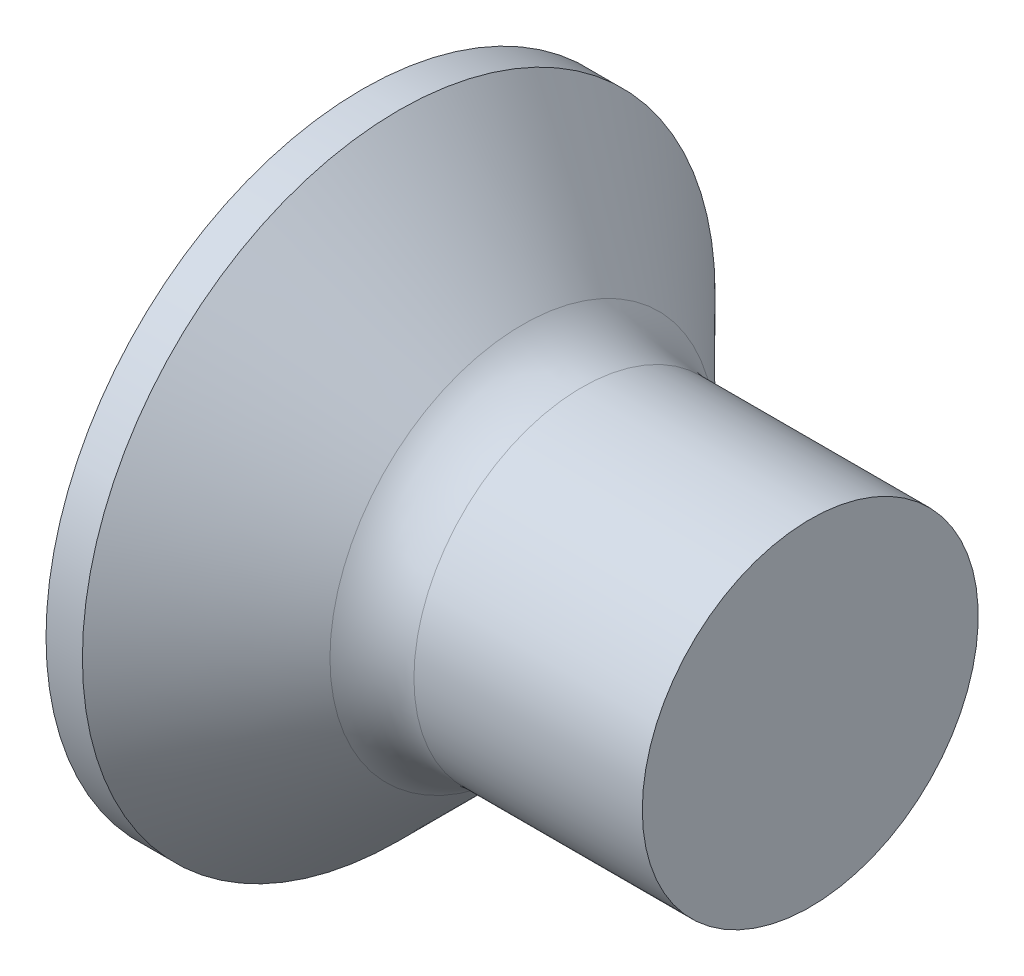
ISO-10303-21;
HEADER;
FILE_DESCRIPTION(('STEP AP214'),'2;1');
FILE_NAME('part.step','',(''),(''),'','','');
FILE_SCHEMA(('AUTOMOTIVE_DESIGN { 1 0 10303 214 1 1 1 1 }'));
ENDSEC;
DATA;
#1=APPLICATION_CONTEXT('core data for automotive mechanical design processes');
#2=APPLICATION_PROTOCOL_DEFINITION('international standard','automotive_design',2000,#1);
#3=PRODUCT_CONTEXT('',#1,'mechanical');
#4=PRODUCT('Part','Part','',(#3));
#5=PRODUCT_RELATED_PRODUCT_CATEGORY('part','',(#4));
#6=PRODUCT_DEFINITION_FORMATION('','',#4);
#7=PRODUCT_DEFINITION_CONTEXT('part definition',#1,'design');
#8=PRODUCT_DEFINITION('design','',#6,#7);
#9=PRODUCT_DEFINITION_SHAPE('','',#8);
#10=(LENGTH_UNIT() NAMED_UNIT(*) SI_UNIT(.MILLI.,.METRE.));
#11=(NAMED_UNIT(*) PLANE_ANGLE_UNIT() SI_UNIT($,.RADIAN.));
#12=(NAMED_UNIT(*) SI_UNIT($,.STERADIAN.) SOLID_ANGLE_UNIT());
#13=UNCERTAINTY_MEASURE_WITH_UNIT(LENGTH_MEASURE(1.E-05),#10,'distance_accuracy_value','');
#14=(GEOMETRIC_REPRESENTATION_CONTEXT(3) GLOBAL_UNCERTAINTY_ASSIGNED_CONTEXT((#13)) GLOBAL_UNIT_ASSIGNED_CONTEXT((#10,
#11,#12)) REPRESENTATION_CONTEXT('',''));
#15=CARTESIAN_POINT('',(0.,0.,0.));
#16=DIRECTION('',(0.,0.,1.));
#17=DIRECTION('',(1.,0.,0.));
#18=AXIS2_PLACEMENT_3D('',#15,#16,#17);
#19=CARTESIAN_POINT('',(3.45,-1.57989373987161,0.71));
#20=DIRECTION('',(0.,0.,-1.));
#21=DIRECTION('',(0.,1.,0.));
#22=AXIS2_PLACEMENT_3D('',#19,#20,#21);
#23=PLANE('',#22);
#24=DIRECTION('',(0.,-1.,0.));
#25=VECTOR('',#24,1.);
#26=CARTESIAN_POINT('',(0.,3.3,0.71));
#27=LINE('',#26,#25);
#28=CARTESIAN_POINT('',(0.,-1.34596265082799,0.71));
#29=VERTEX_POINT('',#28);
#30=CARTESIAN_POINT('',(0.,-3.3,0.71));
#31=VERTEX_POINT('',#30);
#32=EDGE_CURVE('E312',#29,#31,#27,.T.);
#33=ORIENTED_EDGE('',*,*,#32,.F.);
#34=CARTESIAN_POINT('',(-2.33070172998508,-1.52780949048026,0.71));
#35=CARTESIAN_POINT('',(-1.86765508847817,-1.49209744049213,0.71));
#36=CARTESIAN_POINT('',(-1.40462429920518,-1.45617785782921,0.71));
#37=CARTESIAN_POINT('',(-0.478598771397555,-1.38378441953518,0.71));
#38=CARTESIAN_POINT('',(-0.0156040335424545,-1.34731055521734,0.71));
#39=CARTESIAN_POINT('',(0.910330236395165,-1.27367048002272,0.71));
#40=CARTESIAN_POINT('',(1.37326976851081,-1.23650426956358,0.71));
#41=CARTESIAN_POINT('',(2.06762023653994,-1.18007469405108,0.71));
#42=CARTESIAN_POINT('',(2.29905881427871,-1.16115160652012,0.71));
#43=CARTESIAN_POINT('',(2.76191562133488,-1.1230403895321,0.71));
#44=CARTESIAN_POINT('',(2.9933338505087,-1.10385225833566,0.71));
#45=CARTESIAN_POINT('',(3.77873671984917,-1.0382140373185,0.71));
#46=CARTESIAN_POINT('',(4.33266232972328,-0.991049175883736,0.71));
#47=CARTESIAN_POINT('',(5.16336946909758,-0.91831891167068,0.71));
#48=CARTESIAN_POINT('',(5.4402378234452,-0.893745347104484,0.71));
#49=CARTESIAN_POINT('',(5.99389989386117,-0.843746126629445,0.71));
#50=CARTESIAN_POINT('',(6.27069360937684,-0.818320464576653,0.71));
#51=CARTESIAN_POINT('',(6.82421204003487,-0.766348392465499,0.71));
#52=CARTESIAN_POINT('',(7.10093674169551,-0.739801838455808,0.71));
#53=CARTESIAN_POINT('',(7.65423177691248,-0.68518575083711,0.71));
#54=CARTESIAN_POINT('',(7.93080211342568,-0.657116247487933,0.71));
#55=CARTESIAN_POINT('',(8.34549763265326,-0.613341372671413,0.71));
#56=CARTESIAN_POINT('',(8.48371076462783,-0.598470406405426,0.71));
#57=CARTESIAN_POINT('',(8.76005877549585,-0.568027000653936,0.71));
#58=CARTESIAN_POINT('',(8.8981936550194,-0.552454566900562,0.71));
#59=CARTESIAN_POINT('',(9.17437105230597,-0.520423781188751,0.71));
#60=CARTESIAN_POINT('',(9.31241356323649,-0.503965369751123,0.71));
#61=CARTESIAN_POINT('',(9.58835148685425,-0.469831580758205,0.71));
#62=CARTESIAN_POINT('',(9.72624689529722,-0.452156169004854,0.71));
#63=CARTESIAN_POINT('',(9.86404214924837,-0.433706703068899,0.71));
#64=B_SPLINE_CURVE_WITH_KNOTS('',3,(#34,#35,#36,#37,#38,#39,#40,#41,#42,#43,#44,#45,#46,#47,#48,
#49,#50,#51,#52,#53,#54,#55,#56,#57,#58,#59,#60,#61,#62,#63),.UNSPECIFIED.,.F.,.F.,(4,2,2,2,2,2,
2,2,2,2,2,2,2,2,4),(0.,1.39326536277937,2.78655258345763,4.17983896374136,4.87647147762522,
5.57310856540425,7.2408931063301,8.07476240245648,8.90863771239455,9.7426204410271,
10.5765866051289,10.9936177320625,11.4106454517929,11.8277012032456,12.2447686788719),.UNSPECIFIED.);
#65=CARTESIAN_POINT('',(3.45,-1.06563607765503,0.710000000000001));
#66=VERTEX_POINT('',#65);
#67=EDGE_CURVE('E192',#29,#66,#64,.T.);
#68=ORIENTED_EDGE('',*,*,#67,.T.);
#69=DIRECTION('',(0.,-1.,0.));
#70=VECTOR('',#69,1.);
#71=CARTESIAN_POINT('',(3.45,1.57989373987161,0.71));
#72=LINE('',#71,#70);
#73=CARTESIAN_POINT('',(3.45,-1.57989373987161,0.71));
#74=VERTEX_POINT('',#73);
#75=EDGE_CURVE('E336',#66,#74,#72,.T.);
#76=ORIENTED_EDGE('',*,*,#75,.T.);
#77=DIRECTION('',(0.894934391398442,0.446197753347436,0.));
#78=VECTOR('',#77,1.);
#79=CARTESIAN_POINT('',(0.,-3.3,0.71));
#80=LINE('',#79,#78);
#81=EDGE_CURVE('E323',#31,#74,#80,.T.);
#82=ORIENTED_EDGE('',*,*,#81,.F.);
#83=EDGE_LOOP('',(#33,#68,#76,#82));
#84=FACE_BOUND('',#83,.T.);
#85=ADVANCED_FACE('F34',(#84),#23,.T.);
#86=CARTESIAN_POINT('',(3.45,1.57989373987161,0.71));
#87=VERTEX_POINT('',#86);
#88=CARTESIAN_POINT('',(3.45,1.06563607765503,0.71));
#89=VERTEX_POINT('',#88);
#90=EDGE_CURVE('E338',#87,#89,#72,.T.);
#91=ORIENTED_EDGE('',*,*,#90,.T.);
#92=CARTESIAN_POINT('',(-2.33070173866617,1.52780949114965,0.71));
#93=CARTESIAN_POINT('',(-1.8676550960516,1.49209744107883,0.71));
#94=CARTESIAN_POINT('',(-1.40462430567099,1.45617785833256,0.71));
#95=CARTESIAN_POINT('',(-0.478598775648202,1.38378441986965,0.71));
#96=CARTESIAN_POINT('',(-0.0156040366855543,1.34731055546627,0.71));
#97=CARTESIAN_POINT('',(0.910330236180616,1.27367048004082,0.71));
#98=CARTESIAN_POINT('',(1.37326977011718,1.2365042694353,0.71));
#99=CARTESIAN_POINT('',(2.06762024087716,1.18007469369746,0.71));
#100=CARTESIAN_POINT('',(2.29905881952609,1.16115160609043,0.71));
#101=CARTESIAN_POINT('',(2.76191562840241,1.12304038894781,0.71));
#102=CARTESIAN_POINT('',(2.99333385848622,1.10385225767286,0.71));
#103=CARTESIAN_POINT('',(3.77873672873618,1.03821403656624,0.71));
#104=CARTESIAN_POINT('',(4.33266233860977,0.991049175120265,0.71));
#105=CARTESIAN_POINT('',(5.16336947798272,0.918318910885573,0.71));
#106=CARTESIAN_POINT('',(5.44023783232977,0.893745346311365,0.71));
#107=CARTESIAN_POINT('',(5.99389990274437,0.843746125817967,0.71));
#108=CARTESIAN_POINT('',(6.27069361825925,0.818320463754828,0.71));
#109=CARTESIAN_POINT('',(6.82421204891561,0.76634839161947,0.71));
#110=CARTESIAN_POINT('',(7.10093675057538,0.73980183759592,0.71));
#111=CARTESIAN_POINT('',(7.65423178578991,0.685185749944023,0.71));
#112=CARTESIAN_POINT('',(7.93080212230156,0.657116246575507,0.71));
#113=CARTESIAN_POINT('',(8.34549764152604,0.613341371722657,0.71));
#114=CARTESIAN_POINT('',(8.48371077349952,0.598470405443331,0.71));
#115=CARTESIAN_POINT('',(8.7600587843649,0.56802699966167,0.71));
#116=CARTESIAN_POINT('',(8.8981936638869,0.552454565891464,0.71));
#117=CARTESIAN_POINT('',(9.17437106116977,0.520423780141059,0.71));
#118=CARTESIAN_POINT('',(9.31241357209815,0.50396536868167,0.71));
#119=CARTESIAN_POINT('',(9.58835149571046,0.469831579636994,0.71));
#120=CARTESIAN_POINT('',(9.7262469041501,0.452156167853647,0.71));
#121=CARTESIAN_POINT('',(9.86404215809699,0.433706701881929,0.71));
#122=B_SPLINE_CURVE_WITH_KNOTS('',3,(#92,#93,#94,#95,#96,#97,#98,#99,#100,#101,#102,#103,#104,
#105,#106,#107,#108,#109,#110,#111,#112,#113,#114,#115,#116,#117,#118,#119,#120,#121),
.UNSPECIFIED.,.F.,.F.,(4,2,2,2,2,2,2,2,2,2,2,2,2,2,4),(0.,1.3932653661116,2.78655259012239,
4.17983897588649,4.87647149251036,5.57310858302948,7.24089312395658,8.07476242008336,
8.9086377300219,9.74262045865579,10.5765866227588,10.9936177496934,11.4106454694248,
11.8277012208788,12.2447686965066),.UNSPECIFIED.);
#123=CARTESIAN_POINT('',(0.,1.34596265082799,0.71));
#124=VERTEX_POINT('',#123);
#125=EDGE_CURVE('E185',#89,#124,#122,.F.);
#126=ORIENTED_EDGE('',*,*,#125,.T.);
#127=CARTESIAN_POINT('',(0.,3.3,0.71));
#128=VERTEX_POINT('',#127);
#129=EDGE_CURVE('E314',#128,#124,#27,.T.);
#130=ORIENTED_EDGE('',*,*,#129,.F.);
#131=DIRECTION('',(0.894934391398442,-0.446197753347436,0.));
#132=VECTOR('',#131,1.);
#133=CARTESIAN_POINT('',(0.,3.3,0.71));
#134=LINE('',#133,#132);
#135=EDGE_CURVE('E63',#128,#87,#134,.T.);
#136=ORIENTED_EDGE('',*,*,#135,.T.);
#137=EDGE_LOOP('',(#91,#126,#130,#136));
#138=FACE_BOUND('',#137,.T.);
#139=ADVANCED_FACE('F167',(#138),#23,.T.);
#140=CARTESIAN_POINT('',(3.45,1.57989373987161,-0.71));
#141=DIRECTION('',(0.,0.,1.));
#142=DIRECTION('',(1.,0.,0.));
#143=AXIS2_PLACEMENT_3D('',#140,#141,#142);
#144=PLANE('',#143);
#145=DIRECTION('',(0.,1.,0.));
#146=VECTOR('',#145,1.);
#147=CARTESIAN_POINT('',(3.45,-1.57989373987161,-0.71));
#148=LINE('',#147,#146);
#149=CARTESIAN_POINT('',(3.45,-1.57989373987161,-0.71));
#150=VERTEX_POINT('',#149);
#151=CARTESIAN_POINT('',(3.45,-1.06563607765503,-0.71));
#152=VERTEX_POINT('',#151);
#153=EDGE_CURVE('E337',#150,#152,#148,.T.);
#154=ORIENTED_EDGE('',*,*,#153,.T.);
#155=CARTESIAN_POINT('',(-2.33070172998508,-1.52780949048026,-0.71));
#156=CARTESIAN_POINT('',(-1.86765508847817,-1.49209744049213,-0.71));
#157=CARTESIAN_POINT('',(-1.40462429920518,-1.45617785782921,-0.71));
#158=CARTESIAN_POINT('',(-0.478598771397555,-1.38378441953518,-0.71));
#159=CARTESIAN_POINT('',(-0.0156040335424545,-1.34731055521734,-0.71));
#160=CARTESIAN_POINT('',(0.910330236395165,-1.27367048002272,-0.71));
#161=CARTESIAN_POINT('',(1.37326976851081,-1.23650426956358,-0.71));
#162=CARTESIAN_POINT('',(2.06762023653994,-1.18007469405108,-0.71));
#163=CARTESIAN_POINT('',(2.29905881427871,-1.16115160652012,-0.71));
#164=CARTESIAN_POINT('',(2.76191562133488,-1.1230403895321,-0.71));
#165=CARTESIAN_POINT('',(2.9933338505087,-1.10385225833566,-0.71));
#166=CARTESIAN_POINT('',(3.77873671984917,-1.0382140373185,-0.71));
#167=CARTESIAN_POINT('',(4.33266232972328,-0.991049175883736,-0.71));
#168=CARTESIAN_POINT('',(5.16336946909758,-0.91831891167068,-0.71));
#169=CARTESIAN_POINT('',(5.4402378234452,-0.893745347104483,-0.71));
#170=CARTESIAN_POINT('',(5.99389989386117,-0.843746126629445,-0.71));
#171=CARTESIAN_POINT('',(6.27069360937684,-0.818320464576653,-0.71));
#172=CARTESIAN_POINT('',(6.82421204003487,-0.766348392465499,-0.71));
#173=CARTESIAN_POINT('',(7.10093674169552,-0.739801838455808,-0.71));
#174=CARTESIAN_POINT('',(7.65423177691248,-0.685185750837109,-0.71));
#175=CARTESIAN_POINT('',(7.93080211342569,-0.657116247487933,-0.71));
#176=CARTESIAN_POINT('',(8.34549763265326,-0.613341372671412,-0.71));
#177=CARTESIAN_POINT('',(8.48371076462783,-0.598470406405425,-0.71));
#178=CARTESIAN_POINT('',(8.76005877549585,-0.568027000653936,-0.71));
#179=CARTESIAN_POINT('',(8.89819365501941,-0.552454566900562,-0.71));
#180=CARTESIAN_POINT('',(9.17437105230597,-0.52042378118875,-0.71));
#181=CARTESIAN_POINT('',(9.31241356323649,-0.503965369751123,-0.71));
#182=CARTESIAN_POINT('',(9.58835148685426,-0.469831580758204,-0.71));
#183=CARTESIAN_POINT('',(9.72624689529723,-0.452156169004853,-0.71));
#184=CARTESIAN_POINT('',(9.86404214924837,-0.433706703068898,-0.71));
#185=B_SPLINE_CURVE_WITH_KNOTS('',3,(#155,#156,#157,#158,#159,#160,#161,#162,#163,#164,#165,
#166,#167,#168,#169,#170,#171,#172,#173,#174,#175,#176,#177,#178,#179,#180,#181,#182,#183,#184),
.UNSPECIFIED.,.F.,.F.,(4,2,2,2,2,2,2,2,2,2,2,2,2,2,4),(0.,1.39326536277937,2.78655258345763,
4.17983896374136,4.87647147762522,5.57310856540425,7.24089310633011,8.07476240245648,
8.90863771239455,9.7426204410271,10.5765866051289,10.9936177320625,11.4106454517929,
11.8277012032456,12.244768678872),.UNSPECIFIED.);
#186=CARTESIAN_POINT('',(0.,-1.34596265082799,-0.71));
#187=VERTEX_POINT('',#186);
#188=EDGE_CURVE('E238',#152,#187,#185,.F.);
#189=ORIENTED_EDGE('',*,*,#188,.T.);
#190=DIRECTION('',(0.,1.,0.));
#191=VECTOR('',#190,1.);
#192=CARTESIAN_POINT('',(0.,-3.3,-0.71));
#193=LINE('',#192,#191);
#194=CARTESIAN_POINT('',(0.,-3.3,-0.71));
#195=VERTEX_POINT('',#194);
#196=EDGE_CURVE('E313',#195,#187,#193,.T.);
#197=ORIENTED_EDGE('',*,*,#196,.F.);
#198=DIRECTION('',(0.894934391398443,0.446197753347436,0.));
#199=VECTOR('',#198,1.);
#200=CARTESIAN_POINT('',(0.,-3.3,-0.71));
#201=LINE('',#200,#199);
#202=EDGE_CURVE('E326',#195,#150,#201,.T.);
#203=ORIENTED_EDGE('',*,*,#202,.T.);
#204=EDGE_LOOP('',(#154,#189,#197,#203));
#205=FACE_BOUND('',#204,.T.);
#206=ADVANCED_FACE('F173',(#205),#144,.T.);
#207=CARTESIAN_POINT('',(0.,1.34596265082799,-0.71));
#208=VERTEX_POINT('',#207);
#209=CARTESIAN_POINT('',(0.,3.3,-0.71));
#210=VERTEX_POINT('',#209);
#211=EDGE_CURVE('E322',#208,#210,#193,.T.);
#212=ORIENTED_EDGE('',*,*,#211,.F.);
#213=CARTESIAN_POINT('',(-2.33070172998508,1.52780949048026,-0.71));
#214=CARTESIAN_POINT('',(-1.86765508847817,1.49209744049213,-0.71));
#215=CARTESIAN_POINT('',(-1.40462429920518,1.45617785782921,-0.71));
#216=CARTESIAN_POINT('',(-0.478598771397555,1.38378441953518,-0.71));
#217=CARTESIAN_POINT('',(-0.0156040335424545,1.34731055521734,-0.71));
#218=CARTESIAN_POINT('',(0.910330236395165,1.27367048002272,-0.71));
#219=CARTESIAN_POINT('',(1.37326976851081,1.23650426956358,-0.71));
#220=CARTESIAN_POINT('',(2.06762023653994,1.18007469405108,-0.71));
#221=CARTESIAN_POINT('',(2.29905881427871,1.16115160652012,-0.71));
#222=CARTESIAN_POINT('',(2.76191562133488,1.1230403895321,-0.71));
#223=CARTESIAN_POINT('',(2.9933338505087,1.10385225833566,-0.71));
#224=CARTESIAN_POINT('',(3.77873671984917,1.0382140373185,-0.71));
#225=CARTESIAN_POINT('',(4.33266232972328,0.991049175883737,-0.71));
#226=CARTESIAN_POINT('',(5.16336946909758,0.91831891167068,-0.71));
#227=CARTESIAN_POINT('',(5.4402378234452,0.893745347104483,-0.71));
#228=CARTESIAN_POINT('',(5.99389989386117,0.843746126629445,-0.71));
#229=CARTESIAN_POINT('',(6.27069360937684,0.818320464576653,-0.71));
#230=CARTESIAN_POINT('',(6.82421204003487,0.766348392465499,-0.71));
#231=CARTESIAN_POINT('',(7.10093674169551,0.739801838455808,-0.71));
#232=CARTESIAN_POINT('',(7.65423177691248,0.685185750837109,-0.71));
#233=CARTESIAN_POINT('',(7.93080211342568,0.657116247487933,-0.71));
#234=CARTESIAN_POINT('',(8.34549763265326,0.613341372671413,-0.71));
#235=CARTESIAN_POINT('',(8.48371076462783,0.598470406405425,-0.71));
#236=CARTESIAN_POINT('',(8.76005877549585,0.568027000653936,-0.71));
#237=CARTESIAN_POINT('',(8.8981936550194,0.552454566900562,-0.71));
#238=CARTESIAN_POINT('',(9.17437105230597,0.520423781188751,-0.71));
#239=CARTESIAN_POINT('',(9.31241356323649,0.503965369751123,-0.71));
#240=CARTESIAN_POINT('',(9.58835148685425,0.469831580758205,-0.71));
#241=CARTESIAN_POINT('',(9.72624689529722,0.452156169004853,-0.71));
#242=CARTESIAN_POINT('',(9.86404214924837,0.433706703068899,-0.71));
#243=B_SPLINE_CURVE_WITH_KNOTS('',3,(#213,#214,#215,#216,#217,#218,#219,#220,#221,#222,#223,
#224,#225,#226,#227,#228,#229,#230,#231,#232,#233,#234,#235,#236,#237,#238,#239,#240,#241,#242),
.UNSPECIFIED.,.F.,.F.,(4,2,2,2,2,2,2,2,2,2,2,2,2,2,4),(0.,1.39326536277937,2.78655258345763,
4.17983896374136,4.87647147762522,5.57310856540425,7.2408931063301,8.07476240245648,
8.90863771239455,9.7426204410271,10.5765866051289,10.9936177320625,11.4106454517929,
11.8277012032456,12.2447686788719),.UNSPECIFIED.);
#244=CARTESIAN_POINT('',(3.45,1.06563607765503,-0.71));
#245=VERTEX_POINT('',#244);
#246=EDGE_CURVE('E233',#208,#245,#243,.T.);
#247=ORIENTED_EDGE('',*,*,#246,.T.);
#248=CARTESIAN_POINT('',(3.45,1.57989373987161,-0.71));
#249=VERTEX_POINT('',#248);
#250=EDGE_CURVE('E343',#245,#249,#148,.T.);
#251=ORIENTED_EDGE('',*,*,#250,.T.);
#252=DIRECTION('',(0.894934391398442,-0.446197753347436,0.));
#253=VECTOR('',#252,1.);
#254=CARTESIAN_POINT('',(0.,3.3,-0.71));
#255=LINE('',#254,#253);
#256=EDGE_CURVE('E330',#210,#249,#255,.T.);
#257=ORIENTED_EDGE('',*,*,#256,.F.);
#258=EDGE_LOOP('',(#212,#247,#251,#257));
#259=FACE_BOUND('',#258,.T.);
#260=ADVANCED_FACE('F460',(#259),#144,.T.);
#261=CARTESIAN_POINT('',(3.45,1.57989373987161,-0.71));
#262=DIRECTION('',(1.,0.,0.));
#263=DIRECTION('',(0.,0.,-1.));
#264=AXIS2_PLACEMENT_3D('',#261,#262,#263);
#265=PLANE('',#264);
#266=CARTESIAN_POINT('',(3.45,0.,0.));
#267=DIRECTION('',(-1.,0.,0.));
#268=DIRECTION('',(0.,0.,1.));
#269=AXIS2_PLACEMENT_3D('',#266,#267,#268);
#270=CIRCLE('',#269,1.2805);
#271=EDGE_CURVE('E282',#152,#66,#270,.T.);
#272=ORIENTED_EDGE('',*,*,#271,.F.);
#273=ORIENTED_EDGE('',*,*,#153,.F.);
#274=DIRECTION('',(0.,0.,-1.));
#275=VECTOR('',#274,1.);
#276=CARTESIAN_POINT('',(3.45,-1.57989373987161,0.71));
#277=LINE('',#276,#275);
#278=EDGE_CURVE('E333',#74,#150,#277,.T.);
#279=ORIENTED_EDGE('',*,*,#278,.F.);
#280=ORIENTED_EDGE('',*,*,#75,.F.);
#281=EDGE_LOOP('',(#272,#273,#279,#280));
#282=FACE_BOUND('',#281,.T.);
#283=ADVANCED_FACE('F417',(#282),#265,.F.);
#284=CARTESIAN_POINT('',(3.45,-0.710000000000004,1.06563607765503));
#285=VERTEX_POINT('',#284);
#286=CARTESIAN_POINT('',(3.45,0.709999999999996,1.06563607765503));
#287=VERTEX_POINT('',#286);
#288=EDGE_CURVE('E275',#285,#287,#270,.T.);
#289=ORIENTED_EDGE('',*,*,#288,.F.);
#290=DIRECTION('',(0.,0.,-1.));
#291=VECTOR('',#290,1.);
#292=CARTESIAN_POINT('',(3.45,-0.710000000000005,1.57989373987161));
#293=LINE('',#292,#291);
#294=CARTESIAN_POINT('',(3.45,-0.710000000000005,1.57989373987161));
#295=VERTEX_POINT('',#294);
#296=EDGE_CURVE('E402',#295,#285,#293,.T.);
#297=ORIENTED_EDGE('',*,*,#296,.F.);
#298=DIRECTION('',(0.,-1.,0.));
#299=VECTOR('',#298,1.);
#300=CARTESIAN_POINT('',(3.45,0.709999999999994,1.57989373987161));
#301=LINE('',#300,#299);
#302=CARTESIAN_POINT('',(3.45,0.709999999999994,1.57989373987161));
#303=VERTEX_POINT('',#302);
#304=EDGE_CURVE('E301',#303,#295,#301,.T.);
#305=ORIENTED_EDGE('',*,*,#304,.F.);
#306=DIRECTION('',(0.,0.,1.));
#307=VECTOR('',#306,1.);
#308=CARTESIAN_POINT('',(3.45,0.710000000000005,-1.5798937398716));
#309=LINE('',#308,#307);
#310=EDGE_CURVE('E199',#287,#303,#309,.T.);
#311=ORIENTED_EDGE('',*,*,#310,.F.);
#312=EDGE_LOOP('',(#289,#297,#305,#311));
#313=FACE_BOUND('',#312,.T.);
#314=ADVANCED_FACE('F452',(#313),#265,.F.);
#315=EDGE_CURVE('E274',#89,#245,#270,.T.);
#316=ORIENTED_EDGE('',*,*,#315,.F.);
#317=ORIENTED_EDGE('',*,*,#90,.F.);
#318=DIRECTION('',(0.,0.,1.));
#319=VECTOR('',#318,1.);
#320=CARTESIAN_POINT('',(3.45,1.57989373987161,-0.71));
#321=LINE('',#320,#319);
#322=EDGE_CURVE('E334',#249,#87,#321,.T.);
#323=ORIENTED_EDGE('',*,*,#322,.F.);
#324=ORIENTED_EDGE('',*,*,#250,.F.);
#325=EDGE_LOOP('',(#316,#317,#323,#324));
#326=FACE_BOUND('',#325,.T.);
#327=ADVANCED_FACE('F432',(#326),#265,.F.);
#328=CARTESIAN_POINT('',(3.45,0.709999999999994,1.57989373987161));
#329=DIRECTION('',(0.,-1.,0.));
#330=DIRECTION('',(1.,0.,0.));
#331=AXIS2_PLACEMENT_3D('',#328,#329,#330);
#332=PLANE('',#331);
#333=CARTESIAN_POINT('',(3.45,0.710000000000005,-1.5798937398716));
#334=VERTEX_POINT('',#333);
#335=CARTESIAN_POINT('',(3.45,0.710000000000004,-1.06563607765503));
#336=VERTEX_POINT('',#335);
#337=EDGE_CURVE('E296',#334,#336,#309,.T.);
#338=ORIENTED_EDGE('',*,*,#337,.T.);
#339=CARTESIAN_POINT('',(-2.33070172998508,0.710000000000005,-1.52780949048025));
#340=CARTESIAN_POINT('',(-1.86765508847817,0.710000000000005,-1.49209744049212));
#341=CARTESIAN_POINT('',(-1.40462429920518,0.710000000000005,-1.45617785782921));
#342=CARTESIAN_POINT('',(-0.478598771397555,0.710000000000005,-1.38378441953518));
#343=CARTESIAN_POINT('',(-0.0156040335424547,0.710000000000005,-1.34731055521733));
#344=CARTESIAN_POINT('',(0.910330236395165,0.710000000000004,-1.27367048002272));
#345=CARTESIAN_POINT('',(1.37326976851081,0.710000000000004,-1.23650426956357));
#346=CARTESIAN_POINT('',(2.06762023653994,0.710000000000004,-1.18007469405108));
#347=CARTESIAN_POINT('',(2.29905881427871,0.710000000000004,-1.16115160652012));
#348=CARTESIAN_POINT('',(2.76191562133488,0.710000000000004,-1.12304038953209));
#349=CARTESIAN_POINT('',(2.9933338505087,0.710000000000004,-1.10385225833565));
#350=CARTESIAN_POINT('',(3.77873671984917,0.710000000000004,-1.0382140373185));
#351=CARTESIAN_POINT('',(4.33266232972328,0.710000000000003,-0.991049175883734));
#352=CARTESIAN_POINT('',(5.16336946909758,0.710000000000003,-0.918318911670678));
#353=CARTESIAN_POINT('',(5.44023782344519,0.710000000000003,-0.893745347104481));
#354=CARTESIAN_POINT('',(5.99389989386117,0.710000000000003,-0.843746126629442));
#355=CARTESIAN_POINT('',(6.27069360937684,0.710000000000003,-0.818320464576651));
#356=CARTESIAN_POINT('',(6.82421204003487,0.710000000000003,-0.766348392465497));
#357=CARTESIAN_POINT('',(7.10093674169551,0.710000000000003,-0.739801838455806));
#358=CARTESIAN_POINT('',(7.65423177691247,0.710000000000002,-0.685185750837107));
#359=CARTESIAN_POINT('',(7.93080211342568,0.710000000000002,-0.657116247487931));
#360=CARTESIAN_POINT('',(8.34549763265326,0.710000000000002,-0.61334137267141));
#361=CARTESIAN_POINT('',(8.48371076462783,0.710000000000002,-0.598470406405423));
#362=CARTESIAN_POINT('',(8.76005877549585,0.710000000000002,-0.568027000653934));
#363=CARTESIAN_POINT('',(8.89819365501941,0.710000000000002,-0.552454566900559));
#364=CARTESIAN_POINT('',(9.17437105230597,0.710000000000002,-0.520423781188748));
#365=CARTESIAN_POINT('',(9.31241356323649,0.710000000000002,-0.50396536975112));
#366=CARTESIAN_POINT('',(9.58835148685426,0.710000000000002,-0.469831580758202));
#367=CARTESIAN_POINT('',(9.72624689529723,0.710000000000002,-0.452156169004851));
#368=CARTESIAN_POINT('',(9.86404214924837,0.710000000000002,-0.433706703068896));
#369=B_SPLINE_CURVE_WITH_KNOTS('',3,(#339,#340,#341,#342,#343,#344,#345,#346,#347,#348,#349,
#350,#351,#352,#353,#354,#355,#356,#357,#358,#359,#360,#361,#362,#363,#364,#365,#366,#367,#368),
.UNSPECIFIED.,.F.,.F.,(4,2,2,2,2,2,2,2,2,2,2,2,2,2,4),(0.,1.39326536277937,2.78655258345763,
4.17983896374136,4.87647147762522,5.57310856540425,7.2408931063301,8.07476240245647,
8.90863771239455,9.7426204410271,10.5765866051289,10.9936177320625,11.4106454517929,
11.8277012032456,12.2447686788719),.UNSPECIFIED.);
#370=CARTESIAN_POINT('',(0.,0.710000000000005,-1.34596265082799));
#371=VERTEX_POINT('',#370);
#372=EDGE_CURVE('E226',#336,#371,#369,.F.);
#373=ORIENTED_EDGE('',*,*,#372,.T.);
#374=DIRECTION('',(0.,0.,1.));
#375=VECTOR('',#374,1.);
#376=CARTESIAN_POINT('',(0.,0.710000000000011,-3.3));
#377=LINE('',#376,#375);
#378=CARTESIAN_POINT('',(0.,0.710000000000011,-3.3));
#379=VERTEX_POINT('',#378);
#380=EDGE_CURVE('E391',#379,#371,#377,.T.);
#381=ORIENTED_EDGE('',*,*,#380,.F.);
#382=DIRECTION('',(0.894934391398443,0.,0.446197753347436));
#383=VECTOR('',#382,1.);
#384=CARTESIAN_POINT('',(0.,0.710000000000011,-3.3));
#385=LINE('',#384,#383);
#386=EDGE_CURVE('E300',#379,#334,#385,.T.);
#387=ORIENTED_EDGE('',*,*,#386,.T.);
#388=EDGE_LOOP('',(#338,#373,#381,#387));
#389=FACE_BOUND('',#388,.T.);
#390=ADVANCED_FACE('F299',(#389),#332,.T.);
#391=CARTESIAN_POINT('',(3.45,-0.709999999999995,-1.57989373987161));
#392=DIRECTION('',(0.,1.,0.));
#393=DIRECTION('',(0.,0.,1.));
#394=AXIS2_PLACEMENT_3D('',#391,#392,#393);
#395=PLANE('',#394);
#396=DIRECTION('',(0.,0.,-1.));
#397=VECTOR('',#396,1.);
#398=CARTESIAN_POINT('',(0.,-0.710000000000011,3.3));
#399=LINE('',#398,#397);
#400=CARTESIAN_POINT('',(0.,-0.709999999999995,-1.345962650828));
#401=VERTEX_POINT('',#400);
#402=CARTESIAN_POINT('',(0.,-0.709999999999989,-3.3));
#403=VERTEX_POINT('',#402);
#404=EDGE_CURVE('E387',#401,#403,#399,.T.);
#405=ORIENTED_EDGE('',*,*,#404,.F.);
#406=CARTESIAN_POINT('',(-2.33070173866617,-0.709999999999995,-1.52780949114965));
#407=CARTESIAN_POINT('',(-1.8676550960516,-0.709999999999995,-1.49209744107883));
#408=CARTESIAN_POINT('',(-1.40462430567099,-0.709999999999995,-1.45617785833257));
#409=CARTESIAN_POINT('',(-0.478598775648203,-0.709999999999995,-1.38378441986965));
#410=CARTESIAN_POINT('',(-0.0156040366855545,-0.709999999999995,-1.34731055546627));
#411=CARTESIAN_POINT('',(0.910330236180616,-0.709999999999996,-1.27367048004082));
#412=CARTESIAN_POINT('',(1.37326977011718,-0.709999999999996,-1.2365042694353));
#413=CARTESIAN_POINT('',(2.06762024087716,-0.709999999999996,-1.18007469369747));
#414=CARTESIAN_POINT('',(2.29905881952609,-0.709999999999996,-1.16115160609043));
#415=CARTESIAN_POINT('',(2.76191562840241,-0.709999999999996,-1.12304038894781));
#416=CARTESIAN_POINT('',(2.99333385848622,-0.709999999999996,-1.10385225767286));
#417=CARTESIAN_POINT('',(3.77873672873618,-0.709999999999996,-1.03821403656625));
#418=CARTESIAN_POINT('',(4.33266233860976,-0.709999999999997,-0.991049175120267));
#419=CARTESIAN_POINT('',(5.16336947798272,-0.709999999999997,-0.918318910885576));
#420=CARTESIAN_POINT('',(5.44023783232976,-0.709999999999997,-0.893745346311368));
#421=CARTESIAN_POINT('',(5.99389990274437,-0.709999999999997,-0.84374612581797));
#422=CARTESIAN_POINT('',(6.27069361825925,-0.709999999999997,-0.818320463754831));
#423=CARTESIAN_POINT('',(6.82421204891561,-0.709999999999997,-0.766348391619473));
#424=CARTESIAN_POINT('',(7.10093675057537,-0.709999999999997,-0.739801837595923));
#425=CARTESIAN_POINT('',(7.6542317857899,-0.709999999999998,-0.685185749944026));
#426=CARTESIAN_POINT('',(7.93080212230155,-0.709999999999998,-0.65711624657551));
#427=CARTESIAN_POINT('',(8.34549764152603,-0.709999999999998,-0.61334137172266));
#428=CARTESIAN_POINT('',(8.48371077349952,-0.709999999999998,-0.598470405443334));
#429=CARTESIAN_POINT('',(8.7600587843649,-0.709999999999998,-0.568026999661673));
#430=CARTESIAN_POINT('',(8.89819366388689,-0.709999999999998,-0.552454565891467));
#431=CARTESIAN_POINT('',(9.17437106116977,-0.709999999999998,-0.520423780141062));
#432=CARTESIAN_POINT('',(9.31241357209815,-0.709999999999998,-0.503965368681673));
#433=CARTESIAN_POINT('',(9.58835149571046,-0.709999999999998,-0.469831579636997));
#434=CARTESIAN_POINT('',(9.72624690415009,-0.709999999999998,-0.45215616785365));
#435=CARTESIAN_POINT('',(9.86404215809699,-0.709999999999998,-0.433706701881932));
#436=B_SPLINE_CURVE_WITH_KNOTS('',3,(#406,#407,#408,#409,#410,#411,#412,#413,#414,#415,#416,
#417,#418,#419,#420,#421,#422,#423,#424,#425,#426,#427,#428,#429,#430,#431,#432,#433,#434,#435),
.UNSPECIFIED.,.F.,.F.,(4,2,2,2,2,2,2,2,2,2,2,2,2,2,4),(0.,1.3932653661116,2.78655259012239,
4.17983897588649,4.87647149251036,5.57310858302948,7.24089312395658,8.07476242008335,
8.90863773002189,9.74262045865578,10.5765866227588,10.9936177496934,11.4106454694247,
11.8277012208788,12.2447686965066),.UNSPECIFIED.);
#437=CARTESIAN_POINT('',(3.45,-0.709999999999996,-1.06563607765503));
#438=VERTEX_POINT('',#437);
#439=EDGE_CURVE('E219',#401,#438,#436,.T.);
#440=ORIENTED_EDGE('',*,*,#439,.T.);
#441=CARTESIAN_POINT('',(3.45,-0.709999999999995,-1.57989373987161));
#442=VERTEX_POINT('',#441);
#443=EDGE_CURVE('E298',#438,#442,#293,.T.);
#444=ORIENTED_EDGE('',*,*,#443,.T.);
#445=DIRECTION('',(0.894934391398442,0.,0.446197753347436));
#446=VECTOR('',#445,1.);
#447=CARTESIAN_POINT('',(0.,-0.709999999999989,-3.3));
#448=LINE('',#447,#446);
#449=EDGE_CURVE('E394',#403,#442,#448,.T.);
#450=ORIENTED_EDGE('',*,*,#449,.F.);
#451=EDGE_LOOP('',(#405,#440,#444,#450));
#452=FACE_BOUND('',#451,.T.);
#453=ADVANCED_FACE('F405',(#452),#395,.T.);
#454=ORIENTED_EDGE('',*,*,#296,.T.);
#455=CARTESIAN_POINT('',(-2.33070173866617,-0.710000000000005,1.52780949114964));
#456=CARTESIAN_POINT('',(-1.8676550960516,-0.710000000000005,1.49209744107883));
#457=CARTESIAN_POINT('',(-1.40462430567099,-0.710000000000005,1.45617785833256));
#458=CARTESIAN_POINT('',(-0.478598775648202,-0.710000000000005,1.38378441986965));
#459=CARTESIAN_POINT('',(-0.0156040366855544,-0.710000000000005,1.34731055546627));
#460=CARTESIAN_POINT('',(0.910330236180616,-0.710000000000004,1.27367048004082));
#461=CARTESIAN_POINT('',(1.37326977011718,-0.710000000000004,1.2365042694353));
#462=CARTESIAN_POINT('',(2.06762024087716,-0.710000000000004,1.18007469369746));
#463=CARTESIAN_POINT('',(2.29905881952609,-0.710000000000004,1.16115160609042));
#464=CARTESIAN_POINT('',(2.76191562840241,-0.710000000000004,1.12304038894781));
#465=CARTESIAN_POINT('',(2.99333385848622,-0.710000000000004,1.10385225767286));
#466=CARTESIAN_POINT('',(3.77873672873618,-0.710000000000004,1.03821403656624));
#467=CARTESIAN_POINT('',(4.33266233860976,-0.710000000000003,0.991049175120263));
#468=CARTESIAN_POINT('',(5.16336947798272,-0.710000000000003,0.918318910885571));
#469=CARTESIAN_POINT('',(5.44023783232976,-0.710000000000003,0.893745346311363));
#470=CARTESIAN_POINT('',(5.99389990274436,-0.710000000000003,0.843746125817966));
#471=CARTESIAN_POINT('',(6.27069361825924,-0.710000000000003,0.818320463754827));
#472=CARTESIAN_POINT('',(6.82421204891561,-0.710000000000003,0.766348391619469));
#473=CARTESIAN_POINT('',(7.10093675057537,-0.710000000000002,0.739801837595919));
#474=CARTESIAN_POINT('',(7.6542317857899,-0.710000000000002,0.685185749944022));
#475=CARTESIAN_POINT('',(7.93080212230155,-0.710000000000002,0.657116246575506));
#476=CARTESIAN_POINT('',(8.34549764152603,-0.710000000000002,0.613341371722656));
#477=CARTESIAN_POINT('',(8.48371077349952,-0.710000000000002,0.598470405443329));
#478=CARTESIAN_POINT('',(8.76005878436489,-0.710000000000002,0.568026999661669));
#479=CARTESIAN_POINT('',(8.89819366388689,-0.710000000000002,0.552454565891462));
#480=CARTESIAN_POINT('',(9.17437106116977,-0.710000000000002,0.520423780141058));
#481=CARTESIAN_POINT('',(9.31241357209815,-0.710000000000002,0.503965368681668));
#482=CARTESIAN_POINT('',(9.58835149571046,-0.710000000000001,0.469831579636992));
#483=CARTESIAN_POINT('',(9.72624690415009,-0.710000000000001,0.452156167853645));
#484=CARTESIAN_POINT('',(9.86404215809699,-0.710000000000001,0.433706701881927));
#485=B_SPLINE_CURVE_WITH_KNOTS('',3,(#455,#456,#457,#458,#459,#460,#461,#462,#463,#464,#465,
#466,#467,#468,#469,#470,#471,#472,#473,#474,#475,#476,#477,#478,#479,#480,#481,#482,#483,#484),
.UNSPECIFIED.,.F.,.F.,(4,2,2,2,2,2,2,2,2,2,2,2,2,2,4),(0.,1.3932653661116,2.78655259012239,
4.17983897588649,4.87647149251036,5.57310858302948,7.24089312395658,8.07476242008335,
8.90863773002189,9.74262045865577,10.5765866227588,10.9936177496934,11.4106454694247,
11.8277012208788,12.2447686965066),.UNSPECIFIED.);
#486=CARTESIAN_POINT('',(0.,-0.710000000000005,1.34596265082799));
#487=VERTEX_POINT('',#486);
#488=EDGE_CURVE('E211',#285,#487,#485,.F.);
#489=ORIENTED_EDGE('',*,*,#488,.T.);
#490=CARTESIAN_POINT('',(0.,-0.710000000000011,3.3));
#491=VERTEX_POINT('',#490);
#492=EDGE_CURVE('E383',#491,#487,#399,.T.);
#493=ORIENTED_EDGE('',*,*,#492,.F.);
#494=DIRECTION('',(0.894934391398442,0.,-0.446197753347436));
#495=VECTOR('',#494,1.);
#496=CARTESIAN_POINT('',(0.,-0.710000000000011,3.3));
#497=LINE('',#496,#495);
#498=EDGE_CURVE('E398',#491,#295,#497,.T.);
#499=ORIENTED_EDGE('',*,*,#498,.T.);
#500=EDGE_LOOP('',(#454,#489,#493,#499));
#501=FACE_BOUND('',#500,.T.);
#502=ADVANCED_FACE('F436',(#501),#395,.T.);
#503=CARTESIAN_POINT('',(0.,0.709999999999995,1.345962650828));
#504=VERTEX_POINT('',#503);
#505=CARTESIAN_POINT('',(0.,0.709999999999988,3.3));
#506=VERTEX_POINT('',#505);
#507=EDGE_CURVE('E393',#504,#506,#377,.T.);
#508=ORIENTED_EDGE('',*,*,#507,.F.);
#509=CARTESIAN_POINT('',(-2.33070173866617,0.709999999999994,1.52780949114965));
#510=CARTESIAN_POINT('',(-1.8676550960516,0.709999999999995,1.49209744107883));
#511=CARTESIAN_POINT('',(-1.40462430567099,0.709999999999995,1.45617785833257));
#512=CARTESIAN_POINT('',(-0.478598775648203,0.709999999999995,1.38378441986965));
#513=CARTESIAN_POINT('',(-0.0156040366855547,0.709999999999995,1.34731055546627));
#514=CARTESIAN_POINT('',(0.910330236180616,0.709999999999995,1.27367048004082));
#515=CARTESIAN_POINT('',(1.37326977011718,0.709999999999996,1.2365042694353));
#516=CARTESIAN_POINT('',(2.06762024087716,0.709999999999996,1.18007469369747));
#517=CARTESIAN_POINT('',(2.29905881952609,0.709999999999996,1.16115160609043));
#518=CARTESIAN_POINT('',(2.76191562840241,0.709999999999996,1.12304038894781));
#519=CARTESIAN_POINT('',(2.99333385848622,0.709999999999996,1.10385225767286));
#520=CARTESIAN_POINT('',(3.77873672873618,0.709999999999996,1.03821403656624));
#521=CARTESIAN_POINT('',(4.33266233860977,0.709999999999996,0.991049175120267));
#522=CARTESIAN_POINT('',(5.16336947798272,0.709999999999997,0.918318910885576));
#523=CARTESIAN_POINT('',(5.44023783232976,0.709999999999997,0.893745346311368));
#524=CARTESIAN_POINT('',(5.99389990274437,0.709999999999997,0.84374612581797));
#525=CARTESIAN_POINT('',(6.27069361825925,0.709999999999997,0.818320463754831));
#526=CARTESIAN_POINT('',(6.82421204891561,0.709999999999997,0.766348391619473));
#527=CARTESIAN_POINT('',(7.10093675057538,0.709999999999997,0.739801837595923));
#528=CARTESIAN_POINT('',(7.65423178578991,0.709999999999998,0.685185749944026));
#529=CARTESIAN_POINT('',(7.93080212230155,0.709999999999998,0.65711624657551));
#530=CARTESIAN_POINT('',(8.34549764152603,0.709999999999998,0.61334137172266));
#531=CARTESIAN_POINT('',(8.48371077349952,0.709999999999998,0.598470405443334));
#532=CARTESIAN_POINT('',(8.7600587843649,0.709999999999998,0.568026999661673));
#533=CARTESIAN_POINT('',(8.89819366388689,0.709999999999998,0.552454565891467));
#534=CARTESIAN_POINT('',(9.17437106116977,0.709999999999998,0.520423780141062));
#535=CARTESIAN_POINT('',(9.31241357209815,0.709999999999998,0.503965368681672));
#536=CARTESIAN_POINT('',(9.58835149571046,0.709999999999999,0.469831579636996));
#537=CARTESIAN_POINT('',(9.7262469041501,0.709999999999999,0.452156167853649));
#538=CARTESIAN_POINT('',(9.86404215809699,0.709999999999999,0.433706701881931));
#539=B_SPLINE_CURVE_WITH_KNOTS('',3,(#509,#510,#511,#512,#513,#514,#515,#516,#517,#518,#519,
#520,#521,#522,#523,#524,#525,#526,#527,#528,#529,#530,#531,#532,#533,#534,#535,#536,#537,#538),
.UNSPECIFIED.,.F.,.F.,(4,2,2,2,2,2,2,2,2,2,2,2,2,2,4),(0.,1.3932653661116,2.78655259012239,
4.17983897588649,4.87647149251036,5.57310858302948,7.24089312395658,8.07476242008335,
8.90863773002189,9.74262045865578,10.5765866227588,10.9936177496934,11.4106454694247,
11.8277012208788,12.2447686965066),.UNSPECIFIED.);
#540=EDGE_CURVE('E11',#504,#287,#539,.T.);
#541=ORIENTED_EDGE('',*,*,#540,.T.);
#542=ORIENTED_EDGE('',*,*,#310,.T.);
#543=DIRECTION('',(0.894934391398442,0.,-0.446197753347436));
#544=VECTOR('',#543,1.);
#545=CARTESIAN_POINT('',(0.,0.709999999999988,3.3));
#546=LINE('',#545,#544);
#547=EDGE_CURVE('E400',#506,#303,#546,.T.);
#548=ORIENTED_EDGE('',*,*,#547,.F.);
#549=EDGE_LOOP('',(#508,#541,#542,#548));
#550=FACE_BOUND('',#549,.T.);
#551=ADVANCED_FACE('F380',(#550),#332,.T.);
#552=CARTESIAN_POINT('',(0.,0.,0.));
#553=DIRECTION('',(-1.,0.,0.));
#554=DIRECTION('',(0.,0.,1.));
#555=AXIS2_PLACEMENT_3D('',#552,#553,#554);
#556=PLANE('',#555);
#557=CARTESIAN_POINT('',(0.,0.,0.));
#558=DIRECTION('',(-1.,0.,0.));
#559=DIRECTION('',(0.,0.,1.));
#560=AXIS2_PLACEMENT_3D('',#557,#558,#559);
#561=CIRCLE('',#560,5.65);
#562=CARTESIAN_POINT('',(0.,0.,5.65));
#563=VERTEX_POINT('',#562);
#564=EDGE_CURVE('E320',#563,#563,#561,.T.);
#565=ORIENTED_EDGE('',*,*,#564,.T.);
#566=EDGE_LOOP('',(#565));
#567=FACE_BOUND('',#566,.T.);
#568=ORIENTED_EDGE('',*,*,#492,.T.);
#569=CARTESIAN_POINT('',(0.,0.,0.));
#570=DIRECTION('',(-1.,0.,0.));
#571=DIRECTION('',(0.,0.,1.));
#572=AXIS2_PLACEMENT_3D('',#569,#570,#571);
#573=CIRCLE('',#572,1.52174750120508);
#574=EDGE_CURVE('E268',#29,#487,#573,.T.);
#575=ORIENTED_EDGE('',*,*,#574,.F.);
#576=ORIENTED_EDGE('',*,*,#32,.T.);
#577=DIRECTION('',(0.,0.,-1.));
#578=VECTOR('',#577,1.);
#579=CARTESIAN_POINT('',(0.,-3.3,0.71));
#580=LINE('',#579,#578);
#581=EDGE_CURVE('E317',#31,#195,#580,.T.);
#582=ORIENTED_EDGE('',*,*,#581,.T.);
#583=ORIENTED_EDGE('',*,*,#196,.T.);
#584=EDGE_CURVE('E270',#401,#187,#573,.T.);
#585=ORIENTED_EDGE('',*,*,#584,.F.);
#586=ORIENTED_EDGE('',*,*,#404,.T.);
#587=DIRECTION('',(0.,1.,0.));
#588=VECTOR('',#587,1.);
#589=CARTESIAN_POINT('',(0.,-0.709999999999989,-3.3));
#590=LINE('',#589,#588);
#591=EDGE_CURVE('E386',#403,#379,#590,.T.);
#592=ORIENTED_EDGE('',*,*,#591,.T.);
#593=ORIENTED_EDGE('',*,*,#380,.T.);
#594=EDGE_CURVE('E267',#208,#371,#573,.T.);
#595=ORIENTED_EDGE('',*,*,#594,.F.);
#596=ORIENTED_EDGE('',*,*,#211,.T.);
#597=DIRECTION('',(0.,0.,1.));
#598=VECTOR('',#597,1.);
#599=CARTESIAN_POINT('',(0.,3.3,-0.71));
#600=LINE('',#599,#598);
#601=EDGE_CURVE('E309',#210,#128,#600,.T.);
#602=ORIENTED_EDGE('',*,*,#601,.T.);
#603=ORIENTED_EDGE('',*,*,#129,.T.);
#604=EDGE_CURVE('E263',#504,#124,#573,.T.);
#605=ORIENTED_EDGE('',*,*,#604,.F.);
#606=ORIENTED_EDGE('',*,*,#507,.T.);
#607=DIRECTION('',(0.,-1.,0.));
#608=VECTOR('',#607,1.);
#609=CARTESIAN_POINT('',(0.,0.709999999999988,3.3));
#610=LINE('',#609,#608);
#611=EDGE_CURVE('E200',#506,#491,#610,.T.);
#612=ORIENTED_EDGE('',*,*,#611,.T.);
#613=EDGE_LOOP('',(#568,#575,#576,#582,#583,#585,#586,#592,#593,#595,#596,#602,#603,#605,#606,#612));
#614=FACE_BOUND('',#613,.T.);
#615=ADVANCED_FACE('F376',(#567,#614),#556,.T.);
#616=CARTESIAN_POINT('',(8.,3.,0.));
#617=DIRECTION('',(1.,0.,0.));
#618=DIRECTION('',(0.,0.,-1.));
#619=AXIS2_PLACEMENT_3D('',#616,#617,#618);
#620=PLANE('',#619);
#621=CARTESIAN_POINT('',(8.,0.,0.));
#622=DIRECTION('',(-1.,0.,0.));
#623=DIRECTION('',(0.,0.,1.));
#624=AXIS2_PLACEMENT_3D('',#621,#622,#623);
#625=CIRCLE('',#624,3.);
#626=CARTESIAN_POINT('',(8.,0.,3.));
#627=VERTEX_POINT('',#626);
#628=EDGE_CURVE('E349',#627,#627,#625,.T.);
#629=ORIENTED_EDGE('',*,*,#628,.F.);
#630=EDGE_LOOP('',(#629));
#631=FACE_BOUND('',#630,.T.);
#632=ADVANCED_FACE('F379',(#631),#620,.T.);
#633=CARTESIAN_POINT('',(-6.34999999999999,0.,0.));
#634=DIRECTION('',(-1.,0.,0.));
#635=DIRECTION('',(0.,0.,1.));
#636=AXIS2_PLACEMENT_3D('',#633,#634,#635);
#637=CYLINDRICAL_SURFACE('',#636,3.);
#638=CARTESIAN_POINT('',(3.92132034355964,0.,0.));
#639=DIRECTION('',(-1.,0.,0.));
#640=DIRECTION('',(0.,0.,1.));
#641=AXIS2_PLACEMENT_3D('',#638,#639,#640);
#642=CIRCLE('',#641,3.);
#643=CARTESIAN_POINT('',(3.92132034355964,0.,3.));
#644=VERTEX_POINT('',#643);
#645=EDGE_CURVE('E48',#644,#644,#642,.F.);
#646=ORIENTED_EDGE('',*,*,#645,.T.);
#647=EDGE_LOOP('',(#646));
#648=FACE_BOUND('',#647,.T.);
#649=ORIENTED_EDGE('',*,*,#628,.T.);
#650=EDGE_LOOP('',(#649));
#651=FACE_BOUND('',#650,.T.);
#652=ADVANCED_FACE('F357',(#648,#651),#637,.T.);
#653=CARTESIAN_POINT('',(0.65000000000001,0.,0.));
#654=DIRECTION('',(-1.,0.,0.));
#655=DIRECTION('',(0.,0.,1.));
#656=AXIS2_PLACEMENT_3D('',#653,#654,#655);
#657=CONICAL_SURFACE('',#656,5.65,0.78539816339745);
#658=CARTESIAN_POINT('',(2.86066017177982,0.,0.));
#659=DIRECTION('',(-1.,0.,0.));
#660=DIRECTION('',(0.,0.,1.));
#661=AXIS2_PLACEMENT_3D('',#658,#659,#660);
#662=CIRCLE('',#661,3.43933982822018);
#663=CARTESIAN_POINT('',(2.86066017177982,0.,3.43933982822018));
#664=VERTEX_POINT('',#663);
#665=EDGE_CURVE('E352',#664,#664,#662,.T.);
#666=ORIENTED_EDGE('',*,*,#665,.T.);
#667=EDGE_LOOP('',(#666));
#668=FACE_BOUND('',#667,.T.);
#669=CARTESIAN_POINT('',(0.65000000000001,0.,0.));
#670=DIRECTION('',(-1.,0.,0.));
#671=DIRECTION('',(0.,0.,1.));
#672=AXIS2_PLACEMENT_3D('',#669,#670,#671);
#673=CIRCLE('',#672,5.65);
#674=CARTESIAN_POINT('',(0.65000000000001,0.,5.65));
#675=VERTEX_POINT('',#674);
#676=EDGE_CURVE('E346',#675,#675,#673,.T.);
#677=ORIENTED_EDGE('',*,*,#676,.F.);
#678=EDGE_LOOP('',(#677));
#679=FACE_BOUND('',#678,.T.);
#680=ADVANCED_FACE('F365',(#668,#679),#657,.T.);
#681=CARTESIAN_POINT('',(-6.34999999999999,0.,0.));
#682=DIRECTION('',(-1.,0.,0.));
#683=DIRECTION('',(0.,0.,1.));
#684=AXIS2_PLACEMENT_3D('',#681,#682,#683);
#685=CYLINDRICAL_SURFACE('',#684,5.65);
#686=ORIENTED_EDGE('',*,*,#676,.T.);
#687=EDGE_LOOP('',(#686));
#688=FACE_BOUND('',#687,.T.);
#689=ORIENTED_EDGE('',*,*,#564,.F.);
#690=EDGE_LOOP('',(#689));
#691=FACE_BOUND('',#690,.T.);
#692=ADVANCED_FACE('F362',(#688,#691),#685,.T.);
#693=CARTESIAN_POINT('',(3.92132034355964,0.,0.));
#694=DIRECTION('',(-1.,0.,0.));
#695=DIRECTION('',(0.,0.,1.));
#696=AXIS2_PLACEMENT_3D('',#693,#694,#695);
#697=TOROIDAL_SURFACE('',#696,4.5,1.5);
#698=ORIENTED_EDGE('',*,*,#645,.F.);
#699=EDGE_LOOP('',(#698));
#700=FACE_BOUND('',#699,.T.);
#701=ORIENTED_EDGE('',*,*,#665,.F.);
#702=EDGE_LOOP('',(#701));
#703=FACE_BOUND('',#702,.T.);
#704=ADVANCED_FACE('F36',(#700,#703),#697,.F.);
#705=EDGE_CURVE('E287',#336,#438,#270,.T.);
#706=ORIENTED_EDGE('',*,*,#705,.F.);
#707=ORIENTED_EDGE('',*,*,#337,.F.);
#708=DIRECTION('',(0.,1.,0.));
#709=VECTOR('',#708,1.);
#710=CARTESIAN_POINT('',(3.45,-0.709999999999995,-1.57989373987161));
#711=LINE('',#710,#709);
#712=EDGE_CURVE('E307',#442,#334,#711,.T.);
#713=ORIENTED_EDGE('',*,*,#712,.F.);
#714=ORIENTED_EDGE('',*,*,#443,.F.);
#715=EDGE_LOOP('',(#706,#707,#713,#714));
#716=FACE_BOUND('',#715,.T.);
#717=ADVANCED_FACE('F294',(#716),#265,.F.);
#718=CARTESIAN_POINT('',(3.45,-1.57989373987161,-0.71));
#719=DIRECTION('',(-0.446197753347436,0.894934391398443,0.));
#720=DIRECTION('',(-0.894934391398443,-0.446197753347436,0.));
#721=AXIS2_PLACEMENT_3D('',#718,#719,#720);
#722=PLANE('',#721);
#723=ORIENTED_EDGE('',*,*,#202,.F.);
#724=ORIENTED_EDGE('',*,*,#581,.F.);
#725=ORIENTED_EDGE('',*,*,#81,.T.);
#726=ORIENTED_EDGE('',*,*,#278,.T.);
#727=EDGE_LOOP('',(#723,#724,#725,#726));
#728=FACE_BOUND('',#727,.T.);
#729=ADVANCED_FACE('F179',(#728),#722,.T.);
#730=CARTESIAN_POINT('',(3.45,1.57989373987161,0.71));
#731=DIRECTION('',(-0.446197753347436,-0.894934391398443,0.));
#732=DIRECTION('',(0.894934391398443,-0.446197753347436,0.));
#733=AXIS2_PLACEMENT_3D('',#730,#731,#732);
#734=PLANE('',#733);
#735=ORIENTED_EDGE('',*,*,#135,.F.);
#736=ORIENTED_EDGE('',*,*,#601,.F.);
#737=ORIENTED_EDGE('',*,*,#256,.T.);
#738=ORIENTED_EDGE('',*,*,#322,.T.);
#739=EDGE_LOOP('',(#735,#736,#737,#738));
#740=FACE_BOUND('',#739,.T.);
#741=ADVANCED_FACE('F429',(#740),#734,.T.);
#742=CARTESIAN_POINT('',(3.45,0.710000000000005,-1.5798937398716));
#743=DIRECTION('',(-0.446197753347436,0.,0.894934391398443));
#744=DIRECTION('',(-0.894934391398443,0.,-0.446197753347436));
#745=AXIS2_PLACEMENT_3D('',#742,#743,#744);
#746=PLANE('',#745);
#747=ORIENTED_EDGE('',*,*,#386,.F.);
#748=ORIENTED_EDGE('',*,*,#591,.F.);
#749=ORIENTED_EDGE('',*,*,#449,.T.);
#750=ORIENTED_EDGE('',*,*,#712,.T.);
#751=EDGE_LOOP('',(#747,#748,#749,#750));
#752=FACE_BOUND('',#751,.T.);
#753=ADVANCED_FACE('F204',(#752),#746,.T.);
#754=CARTESIAN_POINT('',(3.45,-0.710000000000005,1.57989373987161));
#755=DIRECTION('',(-0.446197753347436,0.,-0.894934391398443));
#756=DIRECTION('',(0.894934391398443,0.,-0.446197753347436));
#757=AXIS2_PLACEMENT_3D('',#754,#755,#756);
#758=PLANE('',#757);
#759=ORIENTED_EDGE('',*,*,#498,.F.);
#760=ORIENTED_EDGE('',*,*,#611,.F.);
#761=ORIENTED_EDGE('',*,*,#547,.T.);
#762=ORIENTED_EDGE('',*,*,#304,.T.);
#763=EDGE_LOOP('',(#759,#760,#761,#762));
#764=FACE_BOUND('',#763,.T.);
#765=ADVANCED_FACE('F420',(#764),#758,.T.);
#766=CARTESIAN_POINT('',(3.45,0.,0.));
#767=DIRECTION('',(-1.,0.,0.));
#768=DIRECTION('',(0.,0.,1.));
#769=AXIS2_PLACEMENT_3D('',#766,#767,#768);
#770=CONICAL_SURFACE('',#769,1.2805,0.0698131700797659);
#771=ORIENTED_EDGE('',*,*,#574,.T.);
#772=ORIENTED_EDGE('',*,*,#488,.F.);
#773=EDGE_CURVE('E279',#66,#285,#270,.T.);
#774=ORIENTED_EDGE('',*,*,#773,.F.);
#775=ORIENTED_EDGE('',*,*,#67,.F.);
#776=EDGE_LOOP('',(#771,#772,#774,#775));
#777=FACE_BOUND('',#776,.T.);
#778=ADVANCED_FACE('F165',(#777),#770,.F.);
#779=EDGE_CURVE('E55',#287,#89,#270,.T.);
#780=ORIENTED_EDGE('',*,*,#779,.F.);
#781=ORIENTED_EDGE('',*,*,#540,.F.);
#782=ORIENTED_EDGE('',*,*,#604,.T.);
#783=ORIENTED_EDGE('',*,*,#125,.F.);
#784=EDGE_LOOP('',(#780,#781,#782,#783));
#785=FACE_BOUND('',#784,.T.);
#786=ADVANCED_FACE('F419',(#785),#770,.F.);
#787=ORIENTED_EDGE('',*,*,#594,.T.);
#788=ORIENTED_EDGE('',*,*,#372,.F.);
#789=EDGE_CURVE('E278',#245,#336,#270,.T.);
#790=ORIENTED_EDGE('',*,*,#789,.F.);
#791=ORIENTED_EDGE('',*,*,#246,.F.);
#792=EDGE_LOOP('',(#787,#788,#790,#791));
#793=FACE_BOUND('',#792,.T.);
#794=ADVANCED_FACE('F163',(#793),#770,.F.);
#795=EDGE_CURVE('E284',#438,#152,#270,.T.);
#796=ORIENTED_EDGE('',*,*,#795,.F.);
#797=ORIENTED_EDGE('',*,*,#439,.F.);
#798=ORIENTED_EDGE('',*,*,#584,.T.);
#799=ORIENTED_EDGE('',*,*,#188,.F.);
#800=EDGE_LOOP('',(#796,#797,#798,#799));
#801=FACE_BOUND('',#800,.T.);
#802=ADVANCED_FACE('F157',(#801),#770,.F.);
#803=CARTESIAN_POINT('',(3.86605967102623,0.,0.));
#804=DIRECTION('',(-1.,0.,0.));
#805=DIRECTION('',(0.,0.,1.));
#806=AXIS2_PLACEMENT_3D('',#803,#804,#805);
#807=CONICAL_SURFACE('',#806,0.,1.25663706143592);
#808=ORIENTED_EDGE('',*,*,#779,.T.);
#809=ORIENTED_EDGE('',*,*,#315,.T.);
#810=ORIENTED_EDGE('',*,*,#789,.T.);
#811=ORIENTED_EDGE('',*,*,#705,.T.);
#812=ORIENTED_EDGE('',*,*,#795,.T.);
#813=ORIENTED_EDGE('',*,*,#271,.T.);
#814=ORIENTED_EDGE('',*,*,#773,.T.);
#815=ORIENTED_EDGE('',*,*,#288,.T.);
#816=EDGE_LOOP('',(#808,#809,#810,#811,#812,#813,#814,#815));
#817=FACE_BOUND('',#816,.T.);
#818=CARTESIAN_POINT('',(3.86605967102623,0.,0.));
#819=VERTEX_POINT('',#818);
#820=VERTEX_LOOP('',#819);
#821=FACE_BOUND('',#820,.T.);
#822=ADVANCED_FACE('F155',(#817,#821),#807,.F.);
#823=CLOSED_SHELL('',(#85,#139,#206,#260,#283,#314,#327,#390,#453,#502,#551,#615,#632,#652,#680,
#692,#704,#717,#729,#741,#753,#765,#778,#786,#794,#802,#822));
#824=MANIFOLD_SOLID_BREP('B2',#823);
#825=ADVANCED_BREP_SHAPE_REPRESENTATION('',(#18,#824),#14);
#826=SHAPE_DEFINITION_REPRESENTATION(#9,#825);
ENDSEC;
END-ISO-10303-21;
